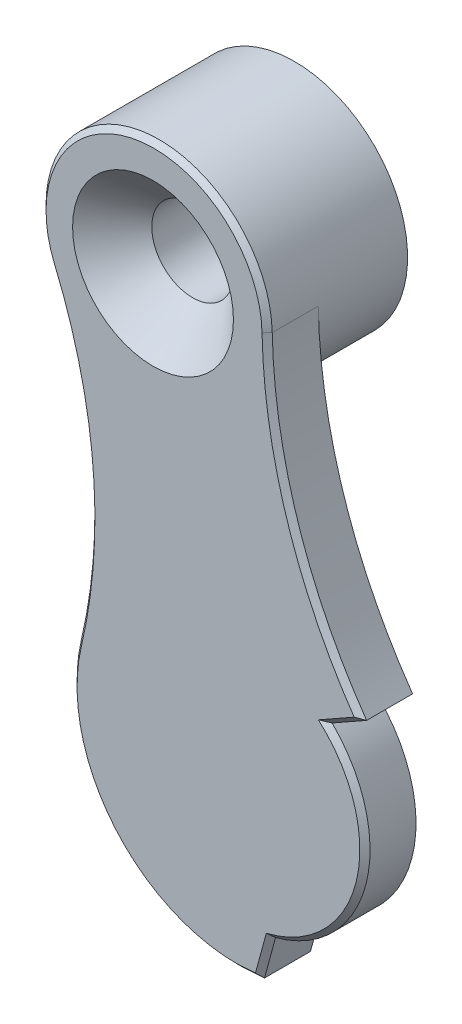
ISO-10303-21;
HEADER;
FILE_DESCRIPTION(('STEP AP214'),'2;1');
FILE_NAME('part.step','',(''),(''),'','','');
FILE_SCHEMA(('AUTOMOTIVE_DESIGN { 1 0 10303 214 1 1 1 1 }'));
ENDSEC;
DATA;
#1=APPLICATION_CONTEXT('core data for automotive mechanical design processes');
#2=APPLICATION_PROTOCOL_DEFINITION('international standard','automotive_design',2000,#1);
#3=PRODUCT_CONTEXT('',#1,'mechanical');
#4=PRODUCT('Part','Part','',(#3));
#5=PRODUCT_RELATED_PRODUCT_CATEGORY('part','',(#4));
#6=PRODUCT_DEFINITION_FORMATION('','',#4);
#7=PRODUCT_DEFINITION_CONTEXT('part definition',#1,'design');
#8=PRODUCT_DEFINITION('design','',#6,#7);
#9=PRODUCT_DEFINITION_SHAPE('','',#8);
#10=(LENGTH_UNIT() NAMED_UNIT(*) SI_UNIT(.MILLI.,.METRE.));
#11=(NAMED_UNIT(*) PLANE_ANGLE_UNIT() SI_UNIT($,.RADIAN.));
#12=(NAMED_UNIT(*) SI_UNIT($,.STERADIAN.) SOLID_ANGLE_UNIT());
#13=UNCERTAINTY_MEASURE_WITH_UNIT(LENGTH_MEASURE(1.E-05),#10,'distance_accuracy_value','');
#14=(GEOMETRIC_REPRESENTATION_CONTEXT(3) GLOBAL_UNCERTAINTY_ASSIGNED_CONTEXT((#13)) GLOBAL_UNIT_ASSIGNED_CONTEXT((#10,
#11,#12)) REPRESENTATION_CONTEXT('',''));
#15=CARTESIAN_POINT('',(0.,0.,0.));
#16=DIRECTION('',(0.,0.,1.));
#17=DIRECTION('',(1.,0.,0.));
#18=AXIS2_PLACEMENT_3D('',#15,#16,#17);
#19=CARTESIAN_POINT('',(-12.24,0.,11.26));
#20=DIRECTION('',(0.,0.,-1.));
#21=DIRECTION('',(-1.,0.,0.));
#22=AXIS2_PLACEMENT_3D('',#19,#20,#21);
#23=PLANE('',#22);
#24=CARTESIAN_POINT('',(-12.24,0.,11.26));
#25=DIRECTION('',(0.,0.,-1.));
#26=DIRECTION('',(-1.,0.,0.));
#27=AXIS2_PLACEMENT_3D('',#24,#25,#26);
#28=CIRCLE('',#27,3.);
#29=CARTESIAN_POINT('',(-15.24,0.,11.26));
#30=VERTEX_POINT('',#29);
#31=EDGE_CURVE('E437',#30,#30,#28,.T.);
#32=ORIENTED_EDGE('',*,*,#31,.T.);
#33=EDGE_LOOP('',(#32));
#34=FACE_BOUND('',#33,.T.);
#35=CARTESIAN_POINT('',(-12.2,0.,11.26));
#36=DIRECTION('',(0.,0.,1.));
#37=DIRECTION('',(1.,0.,0.));
#38=AXIS2_PLACEMENT_3D('',#35,#36,#37);
#39=CIRCLE('',#38,1.52);
#40=CARTESIAN_POINT('',(-10.68,0.,11.26));
#41=VERTEX_POINT('',#40);
#42=EDGE_CURVE('E426',#41,#41,#39,.T.);
#43=ORIENTED_EDGE('',*,*,#42,.T.);
#44=EDGE_LOOP('',(#43));
#45=FACE_BOUND('',#44,.T.);
#46=ADVANCED_FACE('F40',(#34,#45),#23,.T.);
#47=CARTESIAN_POINT('',(-12.2,0.,12.16));
#48=DIRECTION('',(0.,0.,-1.));
#49=DIRECTION('',(-1.,0.,0.));
#50=AXIS2_PLACEMENT_3D('',#47,#48,#49);
#51=PLANE('',#50);
#52=CARTESIAN_POINT('',(-15.4601984254039,15.5311016839438,12.16));
#53=DIRECTION('',(0.,0.,-1.));
#54=DIRECTION('',(-1.,0.,0.));
#55=AXIS2_PLACEMENT_3D('',#52,#53,#54);
#56=CIRCLE('',#55,4.42999999999999);
#57=CARTESIAN_POINT('',(-11.0311737470207,15.6240554265953,12.16));
#58=VERTEX_POINT('',#57);
#59=CARTESIAN_POINT('',(-19.5428698639901,13.811597707632,12.16));
#60=VERTEX_POINT('',#59);
#61=EDGE_CURVE('E139',#58,#60,#56,.T.);
#62=ORIENTED_EDGE('',*,*,#61,.F.);
#63=CARTESIAN_POINT('',(9.40700497301485,16.0529997976395,12.16));
#64=DIRECTION('',(0.,0.,1.));
#65=DIRECTION('',(1.,0.,0.));
#66=AXIS2_PLACEMENT_3D('',#63,#64,#65);
#67=CIRCLE('',#66,20.4426794394855);
#68=CARTESIAN_POINT('',(-7.33409164252474,4.32104229794091,12.16));
#69=VERTEX_POINT('',#68);
#70=EDGE_CURVE('E148',#58,#69,#67,.T.);
#71=ORIENTED_EDGE('',*,*,#70,.T.);
#72=DIRECTION('',(-0.870517660010725,-0.492137179665845,0.));
#73=VECTOR('',#72,1.);
#74=CARTESIAN_POINT('',(-8.68588344763927,3.55682229756059,12.16));
#75=LINE('',#74,#73);
#76=CARTESIAN_POINT('',(-8.68588344763927,3.55682229756059,12.16));
#77=VERTEX_POINT('',#76);
#78=EDGE_CURVE('E155',#69,#77,#75,.T.);
#79=ORIENTED_EDGE('',*,*,#78,.T.);
#80=CARTESIAN_POINT('',(-12.2,0.,12.16));
#81=DIRECTION('',(0.,0.,-1.));
#82=DIRECTION('',(-1.,0.,0.));
#83=AXIS2_PLACEMENT_3D('',#80,#81,#82);
#84=CIRCLE('',#83,5.);
#85=CARTESIAN_POINT('',(-10.9008330403284,-4.82826730938726,12.16));
#86=VERTEX_POINT('',#85);
#87=EDGE_CURVE('E171',#77,#86,#84,.T.);
#88=ORIENTED_EDGE('',*,*,#87,.T.);
#89=DIRECTION('',(-0.263155569416265,-0.964753412165617,0.));
#90=VECTOR('',#89,1.);
#91=CARTESIAN_POINT('',(-10.9008330403284,-4.82826730938726,12.16));
#92=LINE('',#91,#90);
#93=CARTESIAN_POINT('',(-11.3340138569774,-6.41634949162584,12.16));
#94=VERTEX_POINT('',#93);
#95=EDGE_CURVE('E397',#86,#94,#92,.T.);
#96=ORIENTED_EDGE('',*,*,#95,.T.);
#97=DIRECTION('',(-0.997714397222451,-0.0675720472905901,0.));
#98=VECTOR('',#97,1.);
#99=CARTESIAN_POINT('',(-12.2,-6.475,12.16));
#100=LINE('',#99,#98);
#101=CARTESIAN_POINT('',(-12.2,-6.475,12.16));
#102=VERTEX_POINT('',#101);
#103=EDGE_CURVE('E394',#94,#102,#100,.T.);
#104=ORIENTED_EDGE('',*,*,#103,.T.);
#105=CARTESIAN_POINT('',(-12.2,0.,12.16));
#106=DIRECTION('',(0.,0.,-1.));
#107=DIRECTION('',(-1.,0.,0.));
#108=AXIS2_PLACEMENT_3D('',#105,#106,#107);
#109=CIRCLE('',#108,6.475);
#110=CARTESIAN_POINT('',(-18.5037506416512,1.47930823288524,12.16));
#111=VERTEX_POINT('',#110);
#112=EDGE_CURVE('E396',#102,#111,#109,.T.);
#113=ORIENTED_EDGE('',*,*,#112,.T.);
#114=CARTESIAN_POINT('',(-37.9747950946279,6.04860007191303,12.16));
#115=DIRECTION('',(0.,0.,1.));
#116=DIRECTION('',(-1.,0.,0.));
#117=AXIS2_PLACEMENT_3D('',#114,#115,#116);
#118=CIRCLE('',#117,20.);
#119=EDGE_CURVE('E156',#111,#60,#118,.T.);
#120=ORIENTED_EDGE('',*,*,#119,.T.);
#121=EDGE_LOOP('',(#62,#71,#79,#88,#96,#104,#113,#120));
#122=FACE_BOUND('',#121,.T.);
#123=CARTESIAN_POINT('',(-12.24,0.,12.16));
#124=DIRECTION('',(0.,0.,-1.));
#125=DIRECTION('',(-1.,0.,0.));
#126=AXIS2_PLACEMENT_3D('',#123,#124,#125);
#127=CIRCLE('',#126,3.);
#128=CARTESIAN_POINT('',(-15.24,0.,12.16));
#129=VERTEX_POINT('',#128);
#130=EDGE_CURVE('E434',#129,#129,#127,.T.);
#131=ORIENTED_EDGE('',*,*,#130,.F.);
#132=EDGE_LOOP('',(#131));
#133=FACE_BOUND('',#132,.T.);
#134=ADVANCED_FACE('F159',(#122,#133),#51,.T.);
#135=CARTESIAN_POINT('',(-12.2,0.,14.16));
#136=DIRECTION('',(0.,0.,-1.));
#137=DIRECTION('',(-1.,0.,0.));
#138=AXIS2_PLACEMENT_3D('',#135,#136,#137);
#139=CYLINDRICAL_SURFACE('',#138,5.);
#140=DIRECTION('',(0.,0.,-1.));
#141=VECTOR('',#140,1.);
#142=CARTESIAN_POINT('',(-8.68588344763927,3.55682229756059,14.16));
#143=LINE('',#142,#141);
#144=CARTESIAN_POINT('',(-8.68588344763927,3.55682229756059,13.96));
#145=VERTEX_POINT('',#144);
#146=EDGE_CURVE('E200',#145,#77,#143,.T.);
#147=ORIENTED_EDGE('',*,*,#146,.F.);
#148=CARTESIAN_POINT('',(-12.2,0.,13.96));
#149=DIRECTION('',(0.,0.,-1.));
#150=DIRECTION('',(-1.,0.,0.));
#151=AXIS2_PLACEMENT_3D('',#148,#149,#150);
#152=CIRCLE('',#151,5.);
#153=CARTESIAN_POINT('',(-10.9008330403284,-4.82826730938726,13.96));
#154=VERTEX_POINT('',#153);
#155=EDGE_CURVE('E231',#145,#154,#152,.T.);
#156=ORIENTED_EDGE('',*,*,#155,.T.);
#157=DIRECTION('',(0.,0.,-1.));
#158=VECTOR('',#157,1.);
#159=CARTESIAN_POINT('',(-10.9008330403284,-4.82826730938726,14.16));
#160=LINE('',#159,#158);
#161=EDGE_CURVE('E182',#154,#86,#160,.T.);
#162=ORIENTED_EDGE('',*,*,#161,.T.);
#163=ORIENTED_EDGE('',*,*,#87,.F.);
#164=EDGE_LOOP('',(#147,#156,#162,#163));
#165=FACE_BOUND('',#164,.T.);
#166=ADVANCED_FACE('F311',(#165),#139,.T.);
#167=CARTESIAN_POINT('',(-8.68588344763927,3.55682229756059,14.16));
#168=DIRECTION('',(0.492137179665845,-0.870517660010725,0.));
#169=DIRECTION('',(0.870517660010725,0.492137179665845,0.));
#170=AXIS2_PLACEMENT_3D('',#167,#168,#169);
#171=PLANE('',#170);
#172=DIRECTION('',(0.,0.,-1.));
#173=VECTOR('',#172,1.);
#174=CARTESIAN_POINT('',(-7.33409164252474,4.32104229794091,14.16));
#175=LINE('',#174,#173);
#176=CARTESIAN_POINT('',(-7.33409164252474,4.32104229794091,13.96));
#177=VERTEX_POINT('',#176);
#178=EDGE_CURVE('E144',#177,#69,#175,.T.);
#179=ORIENTED_EDGE('',*,*,#178,.F.);
#180=DIRECTION('',(-0.870517660010725,-0.492137179665845,0.));
#181=VECTOR('',#180,1.);
#182=CARTESIAN_POINT('',(-8.68588344763927,3.55682229756059,13.96));
#183=LINE('',#182,#181);
#184=EDGE_CURVE('E228',#177,#145,#183,.T.);
#185=ORIENTED_EDGE('',*,*,#184,.T.);
#186=ORIENTED_EDGE('',*,*,#146,.T.);
#187=ORIENTED_EDGE('',*,*,#78,.F.);
#188=EDGE_LOOP('',(#179,#185,#186,#187));
#189=FACE_BOUND('',#188,.T.);
#190=ADVANCED_FACE('F340',(#189),#171,.T.);
#191=CARTESIAN_POINT('',(9.40700497301485,16.0529997976395,14.16));
#192=DIRECTION('',(0.,0.,-1.));
#193=DIRECTION('',(-1.,0.,0.));
#194=AXIS2_PLACEMENT_3D('',#191,#192,#193);
#195=CYLINDRICAL_SURFACE('',#194,20.4426794394855);
#196=DIRECTION('',(0.,0.,-1.));
#197=VECTOR('',#196,1.);
#198=CARTESIAN_POINT('',(-11.0311737470207,15.6240554265953,14.16));
#199=LINE('',#198,#197);
#200=CARTESIAN_POINT('',(-11.0311737470207,15.6240554265953,13.96));
#201=VERTEX_POINT('',#200);
#202=EDGE_CURVE('E133',#201,#58,#199,.T.);
#203=ORIENTED_EDGE('',*,*,#202,.F.);
#204=CARTESIAN_POINT('',(9.40700497301485,16.0529997976395,13.96));
#205=DIRECTION('',(0.,0.,-1.));
#206=DIRECTION('',(-1.,0.,0.));
#207=AXIS2_PLACEMENT_3D('',#204,#205,#206);
#208=CIRCLE('',#207,20.4426794394855);
#209=EDGE_CURVE('E225',#201,#177,#208,.F.);
#210=ORIENTED_EDGE('',*,*,#209,.T.);
#211=ORIENTED_EDGE('',*,*,#178,.T.);
#212=ORIENTED_EDGE('',*,*,#70,.F.);
#213=EDGE_LOOP('',(#203,#210,#211,#212));
#214=FACE_BOUND('',#213,.T.);
#215=ADVANCED_FACE('F149',(#214),#195,.F.);
#216=CARTESIAN_POINT('',(-15.4601984254039,15.5311016839438,14.16));
#217=DIRECTION('',(0.,0.,-1.));
#218=DIRECTION('',(-1.,0.,0.));
#219=AXIS2_PLACEMENT_3D('',#216,#217,#218);
#220=CYLINDRICAL_SURFACE('',#219,4.43);
#221=DIRECTION('',(0.,0.,-1.));
#222=VECTOR('',#221,1.);
#223=CARTESIAN_POINT('',(-19.5428698639901,13.811597707632,14.16));
#224=LINE('',#223,#222);
#225=CARTESIAN_POINT('',(-19.5428698639901,13.811597707632,13.96));
#226=VERTEX_POINT('',#225);
#227=EDGE_CURVE('E145',#226,#60,#224,.T.);
#228=ORIENTED_EDGE('',*,*,#227,.F.);
#229=CARTESIAN_POINT('',(-15.4601984254039,15.5311016839438,13.96));
#230=DIRECTION('',(0.,0.,-1.));
#231=DIRECTION('',(-1.,0.,0.));
#232=AXIS2_PLACEMENT_3D('',#229,#230,#231);
#233=CIRCLE('',#232,4.43);
#234=EDGE_CURVE('E141',#226,#201,#233,.T.);
#235=ORIENTED_EDGE('',*,*,#234,.T.);
#236=ORIENTED_EDGE('',*,*,#202,.T.);
#237=ORIENTED_EDGE('',*,*,#61,.T.);
#238=EDGE_LOOP('',(#228,#235,#236,#237));
#239=FACE_BOUND('',#238,.T.);
#240=CARTESIAN_POINT('',(-15.4601984254039,15.5311016839438,8.65999999999999));
#241=DIRECTION('',(0.,0.,-1.));
#242=DIRECTION('',(-1.,0.,0.));
#243=AXIS2_PLACEMENT_3D('',#240,#241,#242);
#244=CIRCLE('',#243,4.42999999999999);
#245=CARTESIAN_POINT('',(-19.8901984254039,15.5311016839438,8.65999999999999));
#246=VERTEX_POINT('',#245);
#247=EDGE_CURVE('E164',#246,#246,#244,.T.);
#248=ORIENTED_EDGE('',*,*,#247,.F.);
#249=EDGE_LOOP('',(#248));
#250=FACE_BOUND('',#249,.T.);
#251=ADVANCED_FACE('F136',(#239,#250),#220,.T.);
#252=CARTESIAN_POINT('',(-37.9747950946279,6.04860007191303,14.16));
#253=DIRECTION('',(0.,0.,-1.));
#254=DIRECTION('',(-1.,0.,0.));
#255=AXIS2_PLACEMENT_3D('',#252,#253,#254);
#256=CYLINDRICAL_SURFACE('',#255,20.);
#257=DIRECTION('',(0.,0.,-1.));
#258=VECTOR('',#257,1.);
#259=CARTESIAN_POINT('',(-18.5037506416512,1.47930823288524,14.16));
#260=LINE('',#259,#258);
#261=CARTESIAN_POINT('',(-18.5037506416512,1.47930823288524,13.96));
#262=VERTEX_POINT('',#261);
#263=EDGE_CURVE('E196',#262,#111,#260,.T.);
#264=ORIENTED_EDGE('',*,*,#263,.F.);
#265=CARTESIAN_POINT('',(-37.9747950946279,6.04860007191303,13.96));
#266=DIRECTION('',(0.,0.,-1.));
#267=DIRECTION('',(-1.,0.,0.));
#268=AXIS2_PLACEMENT_3D('',#265,#266,#267);
#269=CIRCLE('',#268,20.);
#270=EDGE_CURVE('E11',#262,#226,#269,.F.);
#271=ORIENTED_EDGE('',*,*,#270,.T.);
#272=ORIENTED_EDGE('',*,*,#227,.T.);
#273=ORIENTED_EDGE('',*,*,#119,.F.);
#274=EDGE_LOOP('',(#264,#271,#272,#273));
#275=FACE_BOUND('',#274,.T.);
#276=ADVANCED_FACE('F348',(#275),#256,.F.);
#277=CARTESIAN_POINT('',(-12.2,0.,14.16));
#278=DIRECTION('',(0.,0.,-1.));
#279=DIRECTION('',(-1.,0.,0.));
#280=AXIS2_PLACEMENT_3D('',#277,#278,#279);
#281=CYLINDRICAL_SURFACE('',#280,6.475);
#282=DIRECTION('',(0.,0.,-1.));
#283=VECTOR('',#282,1.);
#284=CARTESIAN_POINT('',(-12.2,-6.475,14.16));
#285=LINE('',#284,#283);
#286=CARTESIAN_POINT('',(-12.2,-6.475,13.96));
#287=VERTEX_POINT('',#286);
#288=EDGE_CURVE('E412',#287,#102,#285,.T.);
#289=ORIENTED_EDGE('',*,*,#288,.F.);
#290=CARTESIAN_POINT('',(-12.2,0.,13.96));
#291=DIRECTION('',(0.,0.,-1.));
#292=DIRECTION('',(-1.,0.,0.));
#293=AXIS2_PLACEMENT_3D('',#290,#291,#292);
#294=CIRCLE('',#293,6.475);
#295=EDGE_CURVE('E51',#287,#262,#294,.T.);
#296=ORIENTED_EDGE('',*,*,#295,.T.);
#297=ORIENTED_EDGE('',*,*,#263,.T.);
#298=ORIENTED_EDGE('',*,*,#112,.F.);
#299=EDGE_LOOP('',(#289,#296,#297,#298));
#300=FACE_BOUND('',#299,.T.);
#301=ADVANCED_FACE('F351',(#300),#281,.T.);
#302=CARTESIAN_POINT('',(-12.2,-6.475,14.16));
#303=DIRECTION('',(0.0675720472905901,-0.997714397222451,0.));
#304=DIRECTION('',(0.997714397222451,0.0675720472905901,0.));
#305=AXIS2_PLACEMENT_3D('',#302,#303,#304);
#306=PLANE('',#305);
#307=DIRECTION('',(0.,0.,-1.));
#308=VECTOR('',#307,1.);
#309=CARTESIAN_POINT('',(-11.3340138569774,-6.41634949162584,14.16));
#310=LINE('',#309,#308);
#311=CARTESIAN_POINT('',(-11.3340138569774,-6.41634949162584,13.96));
#312=VERTEX_POINT('',#311);
#313=EDGE_CURVE('E413',#312,#94,#310,.T.);
#314=ORIENTED_EDGE('',*,*,#313,.F.);
#315=DIRECTION('',(-0.997714397222451,-0.0675720472905901,0.));
#316=VECTOR('',#315,1.);
#317=CARTESIAN_POINT('',(-12.2,-6.475,13.96));
#318=LINE('',#317,#316);
#319=EDGE_CURVE('E66',#312,#287,#318,.T.);
#320=ORIENTED_EDGE('',*,*,#319,.T.);
#321=ORIENTED_EDGE('',*,*,#288,.T.);
#322=ORIENTED_EDGE('',*,*,#103,.F.);
#323=EDGE_LOOP('',(#314,#320,#321,#322));
#324=FACE_BOUND('',#323,.T.);
#325=ADVANCED_FACE('F355',(#324),#306,.T.);
#326=CARTESIAN_POINT('',(-10.9008330403284,-4.82826730938726,14.16));
#327=DIRECTION('',(0.964753412165617,-0.263155569416265,0.));
#328=DIRECTION('',(0.263155569416265,0.964753412165617,0.));
#329=AXIS2_PLACEMENT_3D('',#326,#327,#328);
#330=PLANE('',#329);
#331=ORIENTED_EDGE('',*,*,#161,.F.);
#332=DIRECTION('',(-0.263155569416265,-0.964753412165617,0.));
#333=VECTOR('',#332,1.);
#334=CARTESIAN_POINT('',(-11.3340138569774,-6.41634949162584,13.96));
#335=LINE('',#334,#333);
#336=EDGE_CURVE('E234',#154,#312,#335,.T.);
#337=ORIENTED_EDGE('',*,*,#336,.T.);
#338=ORIENTED_EDGE('',*,*,#313,.T.);
#339=ORIENTED_EDGE('',*,*,#95,.F.);
#340=EDGE_LOOP('',(#331,#337,#338,#339));
#341=FACE_BOUND('',#340,.T.);
#342=ADVANCED_FACE('F337',(#341),#330,.T.);
#343=CARTESIAN_POINT('',(-12.2,0.,14.16));
#344=DIRECTION('',(0.,0.,-1.));
#345=DIRECTION('',(-1.,0.,0.));
#346=AXIS2_PLACEMENT_3D('',#343,#344,#345);
#347=PLANE('',#346);
#348=CARTESIAN_POINT('',(9.40700497301485,16.0529997976395,14.16));
#349=DIRECTION('',(0.,0.,-1.));
#350=DIRECTION('',(-1.,0.,0.));
#351=AXIS2_PLACEMENT_3D('',#348,#349,#350);
#352=CIRCLE('',#351,20.6426794394855);
#353=CARTESIAN_POINT('',(-7.62330301416917,4.38728831899337,14.16));
#354=VERTEX_POINT('',#353);
#355=CARTESIAN_POINT('',(-11.2311297144421,15.619858869365,14.16));
#356=VERTEX_POINT('',#355);
#357=EDGE_CURVE('E218',#354,#356,#352,.T.);
#358=ORIENTED_EDGE('',*,*,#357,.T.);
#359=CARTESIAN_POINT('',(-15.4601984254039,15.5311016839438,14.16));
#360=DIRECTION('',(0.,0.,-1.));
#361=DIRECTION('',(-1.,0.,0.));
#362=AXIS2_PLACEMENT_3D('',#359,#360,#361);
#363=CIRCLE('',#362,4.23);
#364=CARTESIAN_POINT('',(-19.3585506116837,13.8892276839892,14.16));
#365=VERTEX_POINT('',#364);
#366=EDGE_CURVE('E221',#356,#365,#363,.F.);
#367=ORIENTED_EDGE('',*,*,#366,.T.);
#368=CARTESIAN_POINT('',(-37.9747950946279,6.04860007191303,14.16));
#369=DIRECTION('',(0.,0.,-1.));
#370=DIRECTION('',(-1.,0.,0.));
#371=AXIS2_PLACEMENT_3D('',#368,#369,#370);
#372=CIRCLE('',#371,20.2);
#373=CARTESIAN_POINT('',(-18.3090401971215,1.43361531449496,14.16));
#374=VERTEX_POINT('',#373);
#375=EDGE_CURVE('E199',#365,#374,#372,.T.);
#376=ORIENTED_EDGE('',*,*,#375,.T.);
#377=CARTESIAN_POINT('',(-12.2,0.,14.16));
#378=DIRECTION('',(0.,0.,-1.));
#379=DIRECTION('',(-1.,0.,0.));
#380=AXIS2_PLACEMENT_3D('',#377,#378,#379);
#381=CIRCLE('',#380,6.275);
#382=CARTESIAN_POINT('',(-12.2067119338729,-6.27499641035305,14.16));
#383=VERTEX_POINT('',#382);
#384=EDGE_CURVE('E203',#374,#383,#381,.F.);
#385=ORIENTED_EDGE('',*,*,#384,.T.);
#386=DIRECTION('',(0.997714397222451,0.0675720472905901,0.));
#387=VECTOR('',#386,1.);
#388=CARTESIAN_POINT('',(-11.3475282664356,-6.21680661218135,14.16));
#389=LINE('',#388,#387);
#390=CARTESIAN_POINT('',(-11.4895144804528,-6.22642289034161,14.16));
#391=VERTEX_POINT('',#390);
#392=EDGE_CURVE('E206',#383,#391,#389,.T.);
#393=ORIENTED_EDGE('',*,*,#392,.T.);
#394=DIRECTION('',(0.263155569416265,0.964753412165617,0.));
#395=VECTOR('',#394,1.);
#396=CARTESIAN_POINT('',(-11.0937837227616,-4.77563619550401,14.16));
#397=LINE('',#396,#395);
#398=CARTESIAN_POINT('',(-11.0631789780298,-4.66343628282906,14.16));
#399=VERTEX_POINT('',#398);
#400=EDGE_CURVE('E209',#391,#399,#397,.T.);
#401=ORIENTED_EDGE('',*,*,#400,.T.);
#402=CARTESIAN_POINT('',(-12.2,0.,14.16));
#403=DIRECTION('',(0.,0.,-1.));
#404=DIRECTION('',(-1.,0.,0.));
#405=AXIS2_PLACEMENT_3D('',#402,#403,#404);
#406=CIRCLE('',#405,4.8);
#407=CARTESIAN_POINT('',(-9.02150717428188,3.59682962577577,14.16));
#408=VERTEX_POINT('',#407);
#409=EDGE_CURVE('E212',#399,#408,#406,.F.);
#410=ORIENTED_EDGE('',*,*,#409,.T.);
#411=DIRECTION('',(0.870517660010725,0.492137179665845,0.));
#412=VECTOR('',#411,1.);
#413=CARTESIAN_POINT('',(-7.43251907845791,4.49514582994305,14.16));
#414=LINE('',#413,#412);
#415=EDGE_CURVE('E215',#408,#354,#414,.T.);
#416=ORIENTED_EDGE('',*,*,#415,.T.);
#417=EDGE_LOOP('',(#358,#367,#376,#385,#393,#401,#410,#416));
#418=FACE_BOUND('',#417,.T.);
#419=CARTESIAN_POINT('',(-15.5,15.5,14.16));
#420=DIRECTION('',(0.,0.,1.));
#421=DIRECTION('',(1.,0.,0.));
#422=AXIS2_PLACEMENT_3D('',#419,#420,#421);
#423=CIRCLE('',#422,3.15);
#424=CARTESIAN_POINT('',(-12.35,15.5,14.16));
#425=VERTEX_POINT('',#424);
#426=EDGE_CURVE('E440',#425,#425,#423,.T.);
#427=ORIENTED_EDGE('',*,*,#426,.F.);
#428=EDGE_LOOP('',(#427));
#429=FACE_BOUND('',#428,.T.);
#430=ADVANCED_FACE('F334',(#418,#429),#347,.F.);
#431=CARTESIAN_POINT('',(-15.4601984254039,15.5311016839438,8.65999999999999));
#432=DIRECTION('',(0.,0.,-1.));
#433=DIRECTION('',(-1.,0.,0.));
#434=AXIS2_PLACEMENT_3D('',#431,#432,#433);
#435=PLANE('',#434);
#436=CARTESIAN_POINT('',(-15.5,15.5,8.65999999999999));
#437=DIRECTION('',(0.,0.,1.));
#438=DIRECTION('',(1.,0.,0.));
#439=AXIS2_PLACEMENT_3D('',#436,#437,#438);
#440=CIRCLE('',#439,1.6);
#441=CARTESIAN_POINT('',(-13.9,15.5,8.65999999999999));
#442=VERTEX_POINT('',#441);
#443=EDGE_CURVE('E165',#442,#442,#440,.T.);
#444=ORIENTED_EDGE('',*,*,#443,.T.);
#445=EDGE_LOOP('',(#444));
#446=FACE_BOUND('',#445,.T.);
#447=ORIENTED_EDGE('',*,*,#247,.T.);
#448=EDGE_LOOP('',(#447));
#449=FACE_BOUND('',#448,.T.);
#450=ADVANCED_FACE('F330',(#446,#449),#435,.T.);
#451=CARTESIAN_POINT('',(-15.5,15.5,14.16));
#452=DIRECTION('',(0.,0.,1.));
#453=DIRECTION('',(1.,0.,0.));
#454=AXIS2_PLACEMENT_3D('',#451,#452,#453);
#455=CYLINDRICAL_SURFACE('',#454,1.6);
#456=ORIENTED_EDGE('',*,*,#443,.F.);
#457=EDGE_LOOP('',(#456));
#458=FACE_BOUND('',#457,.T.);
#459=CARTESIAN_POINT('',(-15.5,15.5,12.61));
#460=DIRECTION('',(0.,0.,1.));
#461=DIRECTION('',(1.,0.,0.));
#462=AXIS2_PLACEMENT_3D('',#459,#460,#461);
#463=CIRCLE('',#462,1.6);
#464=CARTESIAN_POINT('',(-13.9,15.5,12.61));
#465=VERTEX_POINT('',#464);
#466=EDGE_CURVE('E175',#465,#465,#463,.T.);
#467=ORIENTED_EDGE('',*,*,#466,.T.);
#468=EDGE_LOOP('',(#467));
#469=FACE_BOUND('',#468,.T.);
#470=ADVANCED_FACE('F326',(#458,#469),#455,.F.);
#471=CARTESIAN_POINT('',(-15.5,15.5,14.16));
#472=DIRECTION('',(0.,0.,1.));
#473=DIRECTION('',(1.,0.,0.));
#474=AXIS2_PLACEMENT_3D('',#471,#472,#473);
#475=CONICAL_SURFACE('',#474,3.15,0.785398163397448);
#476=ORIENTED_EDGE('',*,*,#466,.F.);
#477=EDGE_LOOP('',(#476));
#478=FACE_BOUND('',#477,.T.);
#479=ORIENTED_EDGE('',*,*,#426,.T.);
#480=EDGE_LOOP('',(#479));
#481=FACE_BOUND('',#480,.T.);
#482=ADVANCED_FACE('F322',(#478,#481),#475,.F.);
#483=CARTESIAN_POINT('',(-12.24,0.,11.26));
#484=DIRECTION('',(0.,0.,1.));
#485=DIRECTION('',(1.,0.,0.));
#486=AXIS2_PLACEMENT_3D('',#483,#484,#485);
#487=CYLINDRICAL_SURFACE('',#486,3.);
#488=ORIENTED_EDGE('',*,*,#31,.F.);
#489=EDGE_LOOP('',(#488));
#490=FACE_BOUND('',#489,.T.);
#491=ORIENTED_EDGE('',*,*,#130,.T.);
#492=EDGE_LOOP('',(#491));
#493=FACE_BOUND('',#492,.T.);
#494=ADVANCED_FACE('F319',(#490,#493),#487,.T.);
#495=CARTESIAN_POINT('',(-12.2,0.,13.26));
#496=DIRECTION('',(0.,0.,-1.));
#497=DIRECTION('',(-1.,0.,0.));
#498=AXIS2_PLACEMENT_3D('',#495,#496,#497);
#499=CYLINDRICAL_SURFACE('',#498,1.52);
#500=CARTESIAN_POINT('',(-12.2,0.,13.26));
#501=DIRECTION('',(0.,0.,1.));
#502=DIRECTION('',(1.,0.,0.));
#503=AXIS2_PLACEMENT_3D('',#500,#501,#502);
#504=CIRCLE('',#503,1.52);
#505=CARTESIAN_POINT('',(-10.68,0.,13.26));
#506=VERTEX_POINT('',#505);
#507=EDGE_CURVE('E429',#506,#506,#504,.T.);
#508=ORIENTED_EDGE('',*,*,#507,.T.);
#509=EDGE_LOOP('',(#508));
#510=FACE_BOUND('',#509,.T.);
#511=ORIENTED_EDGE('',*,*,#42,.F.);
#512=EDGE_LOOP('',(#511));
#513=FACE_BOUND('',#512,.T.);
#514=ADVANCED_FACE('F317',(#510,#513),#499,.F.);
#515=CARTESIAN_POINT('',(-12.2,0.,13.26));
#516=DIRECTION('',(0.,0.,1.));
#517=DIRECTION('',(1.,0.,0.));
#518=AXIS2_PLACEMENT_3D('',#515,#516,#517);
#519=PLANE('',#518);
#520=ORIENTED_EDGE('',*,*,#507,.F.);
#521=EDGE_LOOP('',(#520));
#522=FACE_BOUND('',#521,.T.);
#523=ADVANCED_FACE('F302',(#522),#519,.F.);
#524=CARTESIAN_POINT('',(-10.9008330403284,-4.82826730938726,13.96));
#525=DIRECTION('',(0.682183679915174,-0.18607908764125,0.707106781186542));
#526=DIRECTION('',(0.263155569416265,0.964753412165617,0.));
#527=AXIS2_PLACEMENT_3D('',#524,#525,#526);
#528=PLANE('',#527);
#529=CARTESIAN_POINT('',(-10.9008330403284,-4.82826730938726,13.96));
#530=CARTESIAN_POINT('',(-10.9280137851306,-4.80099658603467,13.9933991590253));
#531=CARTESIAN_POINT('',(-10.9551329840882,-4.77362530710719,14.0267654032467));
#532=CARTESIAN_POINT('',(-11.0092482966843,-4.71868163163514,14.0934320699289));
#533=CARTESIAN_POINT('',(-11.0362444102938,-4.69110923504322,14.1267324923742));
#534=CARTESIAN_POINT('',(-11.0631789780298,-4.66343628282906,14.16));
#535=B_SPLINE_CURVE_WITH_KNOTS('',3,(#529,#530,#531,#532,#533,#534),.UNSPECIFIED.,.F.,.F.,(4,2,
4),(0.,0.152910094634257,0.305820225266056),.UNSPECIFIED.);
#536=EDGE_CURVE('E284',#399,#154,#535,.F.);
#537=ORIENTED_EDGE('',*,*,#536,.F.);
#538=ORIENTED_EDGE('',*,*,#400,.F.);
#539=DIRECTION('',(-0.491116362557678,0.599843650083001,0.63165838384622));
#540=VECTOR('',#539,1.);
#541=CARTESIAN_POINT('',(-11.5256075975183,-6.18233918893393,14.2064218293905));
#542=LINE('',#541,#540);
#543=EDGE_CURVE('E45',#312,#391,#542,.T.);
#544=ORIENTED_EDGE('',*,*,#543,.F.);
#545=ORIENTED_EDGE('',*,*,#336,.F.);
#546=EDGE_LOOP('',(#537,#538,#544,#545));
#547=FACE_BOUND('',#546,.T.);
#548=ADVANCED_FACE('F42',(#547),#528,.T.);
#549=CARTESIAN_POINT('',(-12.2,-6.475,13.96));
#550=DIRECTION('',(0.0477806528578349,-0.705490615963451,0.70710678118654));
#551=DIRECTION('',(0.997714397222451,0.0675720472905901,0.));
#552=AXIS2_PLACEMENT_3D('',#549,#550,#551);
#553=PLANE('',#552);
#554=ORIENTED_EDGE('',*,*,#543,.T.);
#555=ORIENTED_EDGE('',*,*,#392,.F.);
#556=CARTESIAN_POINT('',(-12.2,-6.475,13.96));
#557=CARTESIAN_POINT('',(-12.2011275637538,-6.44166651935431,13.993333485341));
#558=CARTESIAN_POINT('',(-12.2022506734533,-6.40833281322989,14.0266668946759));
#559=CARTESIAN_POINT('',(-12.2044879847442,-6.34166495001424,14.0933335613425));
#560=CARTESIAN_POINT('',(-12.2056021863357,-6.30833079292301,14.1266668186744));
#561=CARTESIAN_POINT('',(-12.2067119338729,-6.27499641035305,14.16));
#562=B_SPLINE_CURVE_WITH_KNOTS('',3,(#556,#557,#558,#559,#560,#561),.UNSPECIFIED.,.F.,.F.,(4,2,
4),(0.,0.141462439026884,0.282924878093478),.UNSPECIFIED.);
#563=EDGE_CURVE('E290',#287,#383,#562,.T.);
#564=ORIENTED_EDGE('',*,*,#563,.F.);
#565=ORIENTED_EDGE('',*,*,#319,.F.);
#566=EDGE_LOOP('',(#554,#555,#564,#565));
#567=FACE_BOUND('',#566,.T.);
#568=ADVANCED_FACE('F275',(#567),#553,.T.);
#569=CARTESIAN_POINT('',(-12.2,0.,13.96));
#570=DIRECTION('',(0.,0.,-1.));
#571=DIRECTION('',(-1.,0.,0.));
#572=AXIS2_PLACEMENT_3D('',#569,#570,#571);
#573=CONICAL_SURFACE('',#572,5.,0.785398163397438);
#574=ORIENTED_EDGE('',*,*,#536,.T.);
#575=ORIENTED_EDGE('',*,*,#155,.F.);
#576=CARTESIAN_POINT('',(-8.68588344763927,3.55682229756059,13.96));
#577=CARTESIAN_POINT('',(-8.7414531467055,3.56423524106931,13.9938010132103));
#578=CARTESIAN_POINT('',(-8.79720660964336,3.57127565363512,14.0273681686895));
#579=CARTESIAN_POINT('',(-8.909081184395,3.58461143132029,14.094034836369));
#580=CARTESIAN_POINT('',(-8.96520229700468,3.59090679482621,14.1271343475565));
#581=CARTESIAN_POINT('',(-9.02150717428188,3.59682962577577,14.16));
#582=B_SPLINE_CURVE_WITH_KNOTS('',3,(#576,#577,#578,#579,#580,#581),.UNSPECIFIED.,.F.,.F.,(4,2,
4),(0.,0.196374462928836,0.392749351108703),.UNSPECIFIED.);
#583=EDGE_CURVE('E279',#408,#145,#582,.F.);
#584=ORIENTED_EDGE('',*,*,#583,.F.);
#585=ORIENTED_EDGE('',*,*,#409,.F.);
#586=EDGE_LOOP('',(#574,#575,#584,#585));
#587=FACE_BOUND('',#586,.T.);
#588=ADVANCED_FACE('F270',(#587),#573,.T.);
#589=CARTESIAN_POINT('',(-12.2,0.,13.96));
#590=DIRECTION('',(0.,0.,-1.));
#591=DIRECTION('',(-1.,0.,0.));
#592=AXIS2_PLACEMENT_3D('',#589,#590,#591);
#593=CONICAL_SURFACE('',#592,6.475,0.785398163397438);
#594=ORIENTED_EDGE('',*,*,#563,.T.);
#595=ORIENTED_EDGE('',*,*,#384,.F.);
#596=DIRECTION('',(0.688405378474218,-0.161548862229843,0.707106781186556));
#597=VECTOR('',#596,1.);
#598=CARTESIAN_POINT('',(-18.5037506416512,1.47930823288524,13.96));
#599=LINE('',#598,#597);
#600=EDGE_CURVE('E255',#262,#374,#599,.T.);
#601=ORIENTED_EDGE('',*,*,#600,.F.);
#602=ORIENTED_EDGE('',*,*,#295,.F.);
#603=EDGE_LOOP('',(#594,#595,#601,#602));
#604=FACE_BOUND('',#603,.T.);
#605=ADVANCED_FACE('F274',(#604),#593,.T.);
#606=CARTESIAN_POINT('',(-8.68588344763927,3.55682229756059,13.96));
#607=DIRECTION('',(0.347993537015745,-0.615548940536236,0.70710678118654));
#608=DIRECTION('',(0.870517660010725,0.492137179665845,0.));
#609=AXIS2_PLACEMENT_3D('',#606,#607,#608);
#610=PLANE('',#609);
#611=ORIENTED_EDGE('',*,*,#583,.T.);
#612=ORIENTED_EDGE('',*,*,#184,.F.);
#613=CARTESIAN_POINT('',(-7.33409164252474,4.32104229794091,13.96));
#614=CARTESIAN_POINT('',(-7.38236700066981,4.33196482032632,13.9932663472332));
#615=CARTESIAN_POINT('',(-7.43060562757637,4.34294658331907,14.0265661876532));
#616=CARTESIAN_POINT('',(-7.5270094181233,4.3650285903385,14.093232854321));
#617=CARTESIAN_POINT('',(-7.57517458176489,4.37612883436324,14.1265996805677));
#618=CARTESIAN_POINT('',(-7.62330301416917,4.38728831899338,14.16));
#619=B_SPLINE_CURVE_WITH_KNOTS('',3,(#613,#614,#615,#616,#617,#618),.UNSPECIFIED.,.F.,.F.,(4,2,
4),(0.,0.178907776651275,0.357815550373514),.UNSPECIFIED.);
#620=EDGE_CURVE('E246',#354,#177,#619,.F.);
#621=ORIENTED_EDGE('',*,*,#620,.F.);
#622=ORIENTED_EDGE('',*,*,#415,.F.);
#623=EDGE_LOOP('',(#611,#612,#621,#622));
#624=FACE_BOUND('',#623,.T.);
#625=ADVANCED_FACE('F257',(#624),#610,.T.);
#626=CARTESIAN_POINT('',(-37.9747950946279,6.04860007191303,13.96));
#627=DIRECTION('',(0.,0.,1.));
#628=DIRECTION('',(1.,0.,0.));
#629=AXIS2_PLACEMENT_3D('',#626,#627,#628);
#630=CONICAL_SURFACE('',#629,20.,0.78539816339744);
#631=ORIENTED_EDGE('',*,*,#600,.T.);
#632=ORIENTED_EDGE('',*,*,#375,.F.);
#633=DIRECTION('',(0.651666966045363,0.274463413527599,0.707106781186555));
#634=VECTOR('',#633,1.);
#635=CARTESIAN_POINT('',(-19.5428698639901,13.811597707632,13.96));
#636=LINE('',#635,#634);
#637=EDGE_CURVE('E243',#226,#365,#636,.T.);
#638=ORIENTED_EDGE('',*,*,#637,.F.);
#639=ORIENTED_EDGE('',*,*,#270,.F.);
#640=EDGE_LOOP('',(#631,#632,#638,#639));
#641=FACE_BOUND('',#640,.T.);
#642=ADVANCED_FACE('F265',(#641),#630,.F.);
#643=CARTESIAN_POINT('',(9.40700497301485,16.0529997976395,13.96));
#644=DIRECTION('',(0.,0.,1.));
#645=DIRECTION('',(1.,0.,0.));
#646=AXIS2_PLACEMENT_3D('',#643,#644,#645);
#647=CONICAL_SURFACE('',#646,20.4426794394855,0.78539816339744);
#648=ORIENTED_EDGE('',*,*,#620,.T.);
#649=ORIENTED_EDGE('',*,*,#209,.F.);
#650=DIRECTION('',(0.706951102511805,0.0148370703759731,-0.707106781186548));
#651=VECTOR('',#650,1.);
#652=CARTESIAN_POINT('',(-11.2311297144421,15.619858869365,14.16));
#653=LINE('',#652,#651);
#654=EDGE_CURVE('E241',#356,#201,#653,.T.);
#655=ORIENTED_EDGE('',*,*,#654,.F.);
#656=ORIENTED_EDGE('',*,*,#357,.F.);
#657=EDGE_LOOP('',(#648,#649,#655,#656));
#658=FACE_BOUND('',#657,.T.);
#659=ADVANCED_FACE('F260',(#658),#647,.F.);
#660=CARTESIAN_POINT('',(-15.4601984254039,15.5311016839438,13.96));
#661=DIRECTION('',(0.,0.,-1.));
#662=DIRECTION('',(-1.,0.,0.));
#663=AXIS2_PLACEMENT_3D('',#660,#661,#662);
#664=CONICAL_SURFACE('',#663,4.43,0.785398163397438);
#665=ORIENTED_EDGE('',*,*,#637,.T.);
#666=ORIENTED_EDGE('',*,*,#366,.F.);
#667=ORIENTED_EDGE('',*,*,#654,.T.);
#668=ORIENTED_EDGE('',*,*,#234,.F.);
#669=EDGE_LOOP('',(#665,#666,#667,#668));
#670=FACE_BOUND('',#669,.T.);
#671=ADVANCED_FACE('F264',(#670),#664,.T.);
#672=CLOSED_SHELL('',(#46,#134,#166,#190,#215,#251,#276,#301,#325,#342,#430,#450,#470,#482,#494,
#514,#523,#548,#568,#588,#605,#625,#642,#659,#671));
#673=MANIFOLD_SOLID_BREP('B2',#672);
#674=ADVANCED_BREP_SHAPE_REPRESENTATION('',(#18,#673),#14);
#675=SHAPE_DEFINITION_REPRESENTATION(#9,#674);
ENDSEC;
END-ISO-10303-21;
